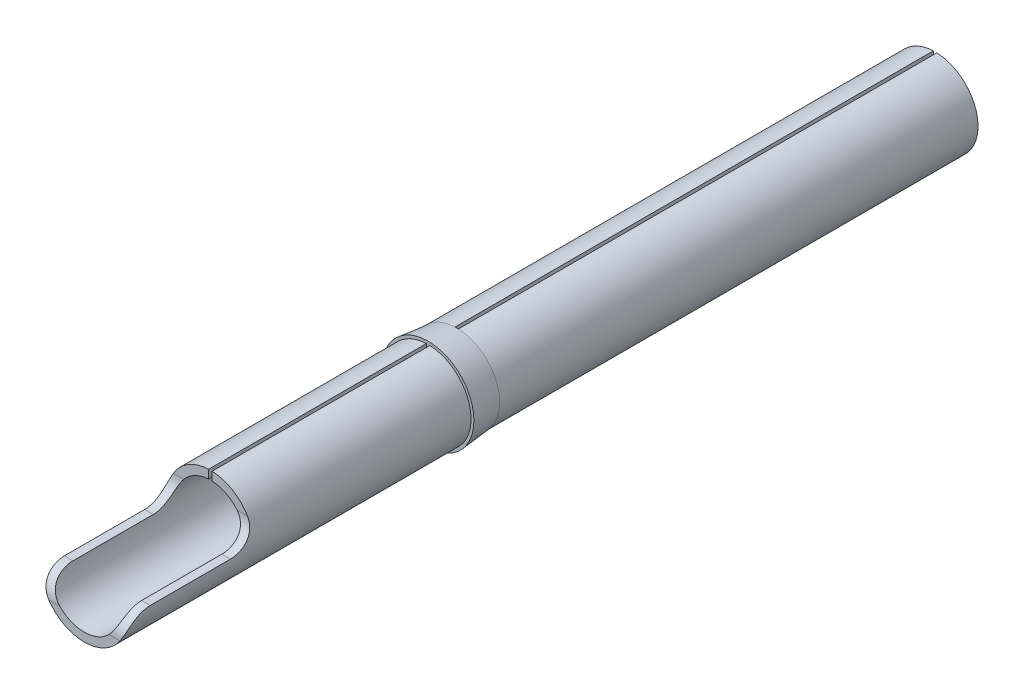
ISO-10303-21;
HEADER;
FILE_DESCRIPTION(('STEP AP214'),'2;1');
FILE_NAME('part.step','',(''),(''),'','','');
FILE_SCHEMA(('AUTOMOTIVE_DESIGN { 1 0 10303 214 1 1 1 1 }'));
ENDSEC;
DATA;
#1=APPLICATION_CONTEXT('core data for automotive mechanical design processes');
#2=APPLICATION_PROTOCOL_DEFINITION('international standard','automotive_design',2000,#1);
#3=PRODUCT_CONTEXT('',#1,'mechanical');
#4=PRODUCT('Part','Part','',(#3));
#5=PRODUCT_RELATED_PRODUCT_CATEGORY('part','',(#4));
#6=PRODUCT_DEFINITION_FORMATION('','',#4);
#7=PRODUCT_DEFINITION_CONTEXT('part definition',#1,'design');
#8=PRODUCT_DEFINITION('design','',#6,#7);
#9=PRODUCT_DEFINITION_SHAPE('','',#8);
#10=(LENGTH_UNIT() NAMED_UNIT(*) SI_UNIT(.MILLI.,.METRE.));
#11=(NAMED_UNIT(*) PLANE_ANGLE_UNIT() SI_UNIT($,.RADIAN.));
#12=(NAMED_UNIT(*) SI_UNIT($,.STERADIAN.) SOLID_ANGLE_UNIT());
#13=UNCERTAINTY_MEASURE_WITH_UNIT(LENGTH_MEASURE(1.E-05),#10,'distance_accuracy_value','');
#14=(GEOMETRIC_REPRESENTATION_CONTEXT(3) GLOBAL_UNCERTAINTY_ASSIGNED_CONTEXT((#13)) GLOBAL_UNIT_ASSIGNED_CONTEXT((#10,
#11,#12)) REPRESENTATION_CONTEXT('',''));
#15=CARTESIAN_POINT('',(0.,0.,0.));
#16=DIRECTION('',(0.,0.,1.));
#17=DIRECTION('',(1.,0.,0.));
#18=AXIS2_PLACEMENT_3D('',#15,#16,#17);
#19=CARTESIAN_POINT('',(0.,0.,5.1));
#20=DIRECTION('',(0.,0.,-1.));
#21=DIRECTION('',(-1.,0.,0.));
#22=AXIS2_PLACEMENT_3D('',#19,#20,#21);
#23=CYLINDRICAL_SURFACE('',#22,0.75);
#24=DIRECTION('',(0.,0.,1.));
#25=VECTOR('',#24,1.);
#26=CARTESIAN_POINT('',(-0.03,0.749399759807808,-0.162251976891754));
#27=LINE('',#26,#25);
#28=CARTESIAN_POINT('',(-0.03,0.749399759807808,8.85));
#29=VERTEX_POINT('',#28);
#30=CARTESIAN_POINT('',(-0.03,0.749399759807808,12.65));
#31=VERTEX_POINT('',#30);
#32=EDGE_CURVE('E219',#29,#31,#27,.T.);
#33=ORIENTED_EDGE('',*,*,#32,.F.);
#34=CARTESIAN_POINT('',(0.,0.,8.85));
#35=DIRECTION('',(0.,0.,1.));
#36=DIRECTION('',(1.,0.,0.));
#37=AXIS2_PLACEMENT_3D('',#34,#35,#36);
#38=CIRCLE('',#37,0.75);
#39=CARTESIAN_POINT('',(0.03,0.749399759807808,8.85));
#40=VERTEX_POINT('',#39);
#41=EDGE_CURVE('E12',#29,#40,#38,.T.);
#42=ORIENTED_EDGE('',*,*,#41,.T.);
#43=DIRECTION('',(0.,0.,1.));
#44=VECTOR('',#43,1.);
#45=CARTESIAN_POINT('',(0.03,0.749399759807808,-0.162251976891754));
#46=LINE('',#45,#44);
#47=CARTESIAN_POINT('',(0.03,0.749399759807808,12.65));
#48=VERTEX_POINT('',#47);
#49=EDGE_CURVE('E212',#40,#48,#46,.T.);
#50=ORIENTED_EDGE('',*,*,#49,.T.);
#51=CARTESIAN_POINT('',(0.,0.,12.65));
#52=DIRECTION('',(0.,0.,1.));
#53=DIRECTION('',(1.,0.,0.));
#54=AXIS2_PLACEMENT_3D('',#51,#52,#53);
#55=CIRCLE('',#54,0.75);
#56=CARTESIAN_POINT('',(0.646606526413089,0.38,12.65));
#57=VERTEX_POINT('',#56);
#58=EDGE_CURVE('E436',#57,#48,#55,.T.);
#59=ORIENTED_EDGE('',*,*,#58,.F.);
#60=CARTESIAN_POINT('',(0.646606526413089,0.38,12.65));
#61=CARTESIAN_POINT('',(0.657724577808599,0.361147262191826,12.6499726603906));
#62=CARTESIAN_POINT('',(0.667980805654465,0.341741106077158,12.6513334436148));
#63=CARTESIAN_POINT('',(0.686638428686348,0.302469029054215,12.6570904737169));
#64=CARTESIAN_POINT('',(0.695037548507881,0.282602576730625,12.6614904173239));
#65=CARTESIAN_POINT('',(0.709851274352495,0.243027928429155,12.673610274622));
#66=CARTESIAN_POINT('',(0.716257883219348,0.223320671726077,12.6813432772396));
#67=CARTESIAN_POINT('',(0.727098065936377,0.184997348853318,12.700102766926));
#68=CARTESIAN_POINT('',(0.73153456435778,0.166379701104829,12.7111243312792));
#69=CARTESIAN_POINT('',(0.738494724045411,0.131973775563877,12.7355121152411));
#70=CARTESIAN_POINT('',(0.74111226215507,0.116085089093548,12.7487107698996));
#71=CARTESIAN_POINT('',(0.745150890739631,0.0864534032905368,12.7774977454362));
#72=CARTESIAN_POINT('',(0.74657118992291,0.0727118279280763,12.7930876387253));
#73=CARTESIAN_POINT('',(0.748604708851185,0.0474928134771258,12.8266393660826));
#74=CARTESIAN_POINT('',(0.749197713387234,0.0360777197089919,12.8446491974092));
#75=CARTESIAN_POINT('',(0.749889341514227,0.0162482533497096,12.8822590287813));
#76=CARTESIAN_POINT('',(0.749987911673621,0.00783420516084064,12.901859200456));
#77=CARTESIAN_POINT('',(0.750010907579072,-0.0059133688295989,12.9425705774586));
#78=CARTESIAN_POINT('',(0.749931641275527,-0.0111786558540255,12.9637048381624));
#79=CARTESIAN_POINT('',(0.749780010416089,-0.0182313805133248,13.0065577390659));
#80=CARTESIAN_POINT('',(0.749707649872757,-0.0200168077526535,13.0282767097256));
#81=CARTESIAN_POINT('',(0.749733285909063,-0.0200000000000002,13.05));
#82=B_SPLINE_CURVE_WITH_KNOTS('',3,(#60,#61,#62,#63,#64,#65,#66,#67,#68,#69,#70,#71,#72,#73,#74,
#75,#76,#77,#78,#79,#80,#81),.UNSPECIFIED.,.F.,.F.,(4,2,2,2,2,2,2,2,2,2,4),(0.,
0.065654366199515,0.131388733048723,0.197383624960302,0.26328021919151,0.325455338419099,
0.387671518925662,0.45138282185834,0.515101009668951,0.580154258444718,0.64524507886098),.UNSPECIFIED.);
#83=CARTESIAN_POINT('',(0.749733285909063,-0.0200000000000002,13.05));
#84=VERTEX_POINT('',#83);
#85=EDGE_CURVE('E245',#57,#84,#82,.T.);
#86=ORIENTED_EDGE('',*,*,#85,.T.);
#87=DIRECTION('',(0.,0.,1.));
#88=VECTOR('',#87,1.);
#89=CARTESIAN_POINT('',(0.749733285909063,-0.0200000000000002,12.65));
#90=LINE('',#89,#88);
#91=CARTESIAN_POINT('',(0.749733285909063,-0.0200000000000002,14.45));
#92=VERTEX_POINT('',#91);
#93=EDGE_CURVE('E425',#84,#92,#90,.T.);
#94=ORIENTED_EDGE('',*,*,#93,.T.);
#95=CARTESIAN_POINT('',(0.749733285909063,-0.0200000000000002,14.45));
#96=CARTESIAN_POINT('',(0.749705313176335,-0.0199807945085876,14.4723986608576));
#97=CARTESIAN_POINT('',(0.749682612462895,-0.021880263276231,14.4947931044411));
#98=CARTESIAN_POINT('',(0.749441311613189,-0.0293784616436176,14.5389499411372));
#99=CARTESIAN_POINT('',(0.749222740780176,-0.0349766378633773,14.560712428291));
#100=CARTESIAN_POINT('',(0.748383080262654,-0.0497393583130032,14.6030034704527));
#101=CARTESIAN_POINT('',(0.747761711479095,-0.0589063736340716,14.6235311590818));
#102=CARTESIAN_POINT('',(0.74574397284353,-0.080523790813975,14.662735466125));
#103=CARTESIAN_POINT('',(0.744347769778462,-0.0929734857570693,14.6814124818864));
#104=CARTESIAN_POINT('',(0.740375622265052,-0.120559900099724,14.7161211057437));
#105=CARTESIAN_POINT('',(0.737815559255623,-0.135658818960957,14.732184494893));
#106=CARTESIAN_POINT('',(0.731110381922275,-0.16807886713201,14.7614675343962));
#107=CARTESIAN_POINT('',(0.726966754579019,-0.18539790162551,14.774689834416));
#108=CARTESIAN_POINT('',(0.717007953552366,-0.22072745205133,14.7974364173075));
#109=CARTESIAN_POINT('',(0.711276252396778,-0.238671931995108,14.807100166541));
#110=CARTESIAN_POINT('',(0.697938428802332,-0.275248279331061,14.8234283904866));
#111=CARTESIAN_POINT('',(0.690329667997059,-0.29388108260357,14.830088605889));
#112=CARTESIAN_POINT('',(0.673396038737874,-0.330820728403151,14.8403961606521));
#113=CARTESIAN_POINT('',(0.66409856443751,-0.349128275066788,14.8440871086032));
#114=CARTESIAN_POINT('',(0.643898424461736,-0.385135869133624,14.8488945527688));
#115=CARTESIAN_POINT('',(0.632999613084823,-0.402837252774911,14.850017126248));
#116=CARTESIAN_POINT('',(0.62136945531624,-0.42,14.85));
#117=B_SPLINE_CURVE_WITH_KNOTS('',3,(#95,#96,#97,#98,#99,#100,#101,#102,#103,#104,#105,#106,
#107,#108,#109,#110,#111,#112,#113,#114,#115,#116),.UNSPECIFIED.,.F.,.F.,(4,2,2,2,2,2,2,2,2,2,
4),(0.,0.0671099370928857,0.134209835844213,0.201356277942451,0.268488272037722,
0.33473050543094,0.400910689020773,0.464117228915708,0.527413122267665,0.589761512177078,
0.651962220631755),.UNSPECIFIED.);
#118=CARTESIAN_POINT('',(0.621369455316239,-0.42,14.85));
#119=VERTEX_POINT('',#118);
#120=EDGE_CURVE('E309',#92,#119,#117,.T.);
#121=ORIENTED_EDGE('',*,*,#120,.T.);
#122=CARTESIAN_POINT('',(0.,0.,14.85));
#123=DIRECTION('',(0.,0.,1.));
#124=DIRECTION('',(1.,0.,0.));
#125=AXIS2_PLACEMENT_3D('',#122,#123,#124);
#126=CIRCLE('',#125,0.75);
#127=CARTESIAN_POINT('',(-0.621369455316239,-0.42,14.85));
#128=VERTEX_POINT('',#127);
#129=EDGE_CURVE('E503',#128,#119,#126,.T.);
#130=ORIENTED_EDGE('',*,*,#129,.F.);
#131=CARTESIAN_POINT('',(-0.621369455316239,-0.42,14.85));
#132=CARTESIAN_POINT('',(-0.634038551035226,-0.401319786375606,14.850026150086));
#133=CARTESIAN_POINT('',(-0.645834332506215,-0.381988213252626,14.8486903658862));
#134=CARTESIAN_POINT('',(-0.667511937410535,-0.342664469991841,14.842950319651));
#135=CARTESIAN_POINT('',(-0.677389163049323,-0.322670844134552,14.8385387998863));
#136=CARTESIAN_POINT('',(-0.695042323699242,-0.282665306582724,14.8262702550832));
#137=CARTESIAN_POINT('',(-0.702808053538053,-0.262653759229463,14.8183969615894));
#138=CARTESIAN_POINT('',(-0.716172499288116,-0.223652927913043,14.7991690941988));
#139=CARTESIAN_POINT('',(-0.721775528058076,-0.204661675105278,14.7878215306277));
#140=CARTESIAN_POINT('',(-0.730702101327177,-0.169918819228703,14.7628607861136));
#141=CARTESIAN_POINT('',(-0.734167148402028,-0.154030545163575,14.7494870871664));
#142=CARTESIAN_POINT('',(-0.739764616090935,-0.12440284754241,14.7202873821128));
#143=CARTESIAN_POINT('',(-0.741896092900284,-0.110664951012497,14.7044596490815));
#144=CARTESIAN_POINT('',(-0.745196526854357,-0.0856907590195608,14.6706425117848));
#145=CARTESIAN_POINT('',(-0.74635702295795,-0.0744770638839885,14.6526356391279));
#146=CARTESIAN_POINT('',(-0.748042087113165,-0.0550270099208982,14.6150538207798));
#147=CARTESIAN_POINT('',(-0.748566604434882,-0.046790888641277,14.5954787501314));
#148=CARTESIAN_POINT('',(-0.74928314423158,-0.0334970373980666,14.5551954694437));
#149=CARTESIAN_POINT('',(-0.749473969002888,-0.0284507978880096,14.5344834517287));
#150=CARTESIAN_POINT('',(-0.749687628756679,-0.02169397447787,14.4925154516707));
#151=CARTESIAN_POINT('',(-0.749710412830097,-0.019984401558839,14.4712593064374));
#152=CARTESIAN_POINT('',(-0.749733285909063,-0.0200000000000002,14.45));
#153=B_SPLINE_CURVE_WITH_KNOTS('',3,(#131,#132,#133,#134,#135,#136,#137,#138,#139,#140,#141,
#142,#143,#144,#145,#146,#147,#148,#149,#150,#151,#152),.UNSPECIFIED.,.F.,.F.,(4,2,2,2,2,2,2,2,
2,2,4),(0.,0.0677233777854022,0.135607103830967,0.203813314280863,0.271882796371903,
0.334749156920054,0.397659959557488,0.461113414903698,0.524571931387288,0.588257751973154,
0.651962865816846),.UNSPECIFIED.);
#154=CARTESIAN_POINT('',(-0.749733285909063,-0.0200000000000002,14.45));
#155=VERTEX_POINT('',#154);
#156=EDGE_CURVE('E316',#128,#155,#153,.T.);
#157=ORIENTED_EDGE('',*,*,#156,.T.);
#158=DIRECTION('',(0.,0.,1.));
#159=VECTOR('',#158,1.);
#160=CARTESIAN_POINT('',(-0.749733285909063,-0.0200000000000002,12.65));
#161=LINE('',#160,#159);
#162=CARTESIAN_POINT('',(-0.749733285909063,-0.0200000000000002,13.05));
#163=VERTEX_POINT('',#162);
#164=EDGE_CURVE('E415',#163,#155,#161,.T.);
#165=ORIENTED_EDGE('',*,*,#164,.F.);
#166=CARTESIAN_POINT('',(-0.749733285909063,-0.0200000000000002,13.05));
#167=CARTESIAN_POINT('',(-0.749704126185465,-0.0200189142169892,13.0275313359366));
#168=CARTESIAN_POINT('',(-0.749783289186051,-0.0181079742170668,13.0050686242918));
#169=CARTESIAN_POINT('',(-0.749942638947083,-0.010564859823982,12.9607853201962));
#170=CARTESIAN_POINT('',(-0.750022825285848,-0.00493417255446931,12.9389644747728));
#171=CARTESIAN_POINT('',(-0.749968905825655,0.00991439656400444,12.8965640915088));
#172=CARTESIAN_POINT('',(-0.749834677875053,0.0191343209349248,12.8759852681795));
#173=CARTESIAN_POINT('',(-0.748963900449902,0.040889187303846,12.8366739115121));
#174=CARTESIAN_POINT('',(-0.748227411442792,0.0534237964196616,12.8179411930352));
#175=CARTESIAN_POINT('',(-0.74571170105682,0.0812831553212815,12.7830511391412));
#176=CARTESIAN_POINT('',(-0.743942652660174,0.0965796924044591,12.7668706077103));
#177=CARTESIAN_POINT('',(-0.738922591166215,0.129497000039341,12.7373728120609));
#178=CARTESIAN_POINT('',(-0.735672912775999,0.14711566717309,12.7240529849508));
#179=CARTESIAN_POINT('',(-0.727525283835041,0.183114362772149,12.7011886858946));
#180=CARTESIAN_POINT('',(-0.722711979628135,0.201419688840804,12.6914961970288));
#181=CARTESIAN_POINT('',(-0.711227994337885,0.238825874470472,12.6751845662024));
#182=CARTESIAN_POINT('',(-0.704555409873282,0.257927532119548,12.6685685923522));
#183=CARTESIAN_POINT('',(-0.690023493950282,0.294479258373856,12.6588331103184));
#184=CARTESIAN_POINT('',(-0.682322178297093,0.311925351067182,12.6554552697895));
#185=CARTESIAN_POINT('',(-0.66550084621469,0.346385416406222,12.6510339927043));
#186=CARTESIAN_POINT('',(-0.656383699741315,0.363400183944838,12.649985898051));
#187=CARTESIAN_POINT('',(-0.646606526413089,0.38,12.65));
#188=B_SPLINE_CURVE_WITH_KNOTS('',3,(#166,#167,#168,#169,#170,#171,#172,#173,#174,#175,#176,
#177,#178,#179,#180,#181,#182,#183,#184,#185,#186,#187),.UNSPECIFIED.,.F.,.F.,(4,2,2,2,2,2,2,2,
2,2,4),(0.,0.0673163137329924,0.13460573124395,0.201933497154372,0.269254504139053,
0.335923186355584,0.402531888936786,0.466010016155712,0.529553367431907,0.587453629540623,
0.645238021261109),.UNSPECIFIED.);
#189=CARTESIAN_POINT('',(-0.646606526413089,0.38,12.65));
#190=VERTEX_POINT('',#189);
#191=EDGE_CURVE('E288',#163,#190,#188,.T.);
#192=ORIENTED_EDGE('',*,*,#191,.T.);
#193=CARTESIAN_POINT('',(0.,0.,12.65));
#194=DIRECTION('',(0.,0.,1.));
#195=DIRECTION('',(1.,0.,0.));
#196=AXIS2_PLACEMENT_3D('',#193,#194,#195);
#197=CIRCLE('',#196,0.75);
#198=EDGE_CURVE('E397',#31,#190,#197,.T.);
#199=ORIENTED_EDGE('',*,*,#198,.F.);
#200=EDGE_LOOP('',(#33,#42,#50,#59,#86,#94,#121,#130,#157,#165,#192,#199));
#201=FACE_BOUND('',#200,.T.);
#202=ADVANCED_FACE('F36',(#201),#23,.T.);
#203=CARTESIAN_POINT('',(0.03,0.749399759807808,-0.162251976891754));
#204=DIRECTION('',(1.,0.,0.));
#205=DIRECTION('',(0.,1.,0.));
#206=AXIS2_PLACEMENT_3D('',#203,#204,#205);
#207=PLANE('',#206);
#208=ORIENTED_EDGE('',*,*,#49,.F.);
#209=DIRECTION('',(0.,-1.,0.));
#210=VECTOR('',#209,1.);
#211=CARTESIAN_POINT('',(0.03,0.749399759807808,8.85));
#212=LINE('',#211,#210);
#213=CARTESIAN_POINT('',(0.03,0.599249530663145,8.85));
#214=VERTEX_POINT('',#213);
#215=EDGE_CURVE('E54',#40,#214,#212,.T.);
#216=ORIENTED_EDGE('',*,*,#215,.T.);
#217=DIRECTION('',(0.,0.,1.));
#218=VECTOR('',#217,1.);
#219=CARTESIAN_POINT('',(0.0299999999999999,0.599249530663145,-0.162251976891754));
#220=LINE('',#219,#218);
#221=CARTESIAN_POINT('',(0.0299999999999999,0.599249530663145,9.2));
#222=VERTEX_POINT('',#221);
#223=EDGE_CURVE('E227',#214,#222,#220,.T.);
#224=ORIENTED_EDGE('',*,*,#223,.T.);
#225=CARTESIAN_POINT('',(0.0299999999999997,0.599249530663145,12.65));
#226=VERTEX_POINT('',#225);
#227=EDGE_CURVE('E228',#222,#226,#220,.T.);
#228=ORIENTED_EDGE('',*,*,#227,.T.);
#229=DIRECTION('',(0.,-1.,0.));
#230=VECTOR('',#229,1.);
#231=CARTESIAN_POINT('',(0.0299999999999999,0.599249530663145,12.65));
#232=LINE('',#231,#230);
#233=EDGE_CURVE('E434',#48,#226,#232,.T.);
#234=ORIENTED_EDGE('',*,*,#233,.F.);
#235=EDGE_LOOP('',(#208,#216,#224,#228,#234));
#236=FACE_BOUND('',#235,.T.);
#237=ADVANCED_FACE('F364',(#236),#207,.F.);
#238=CARTESIAN_POINT('',(-0.03,0.749399759807808,-0.162251976891754));
#239=DIRECTION('',(-1.,0.,0.));
#240=DIRECTION('',(0.,-1.,0.));
#241=AXIS2_PLACEMENT_3D('',#238,#239,#240);
#242=PLANE('',#241);
#243=DIRECTION('',(0.,0.,1.));
#244=VECTOR('',#243,1.);
#245=CARTESIAN_POINT('',(-0.03,0.599249530663146,-0.162251976891754));
#246=LINE('',#245,#244);
#247=CARTESIAN_POINT('',(-0.03,0.599249530663146,8.85));
#248=VERTEX_POINT('',#247);
#249=CARTESIAN_POINT('',(-0.03,0.599249530663146,9.2));
#250=VERTEX_POINT('',#249);
#251=EDGE_CURVE('E231',#248,#250,#246,.T.);
#252=ORIENTED_EDGE('',*,*,#251,.F.);
#253=DIRECTION('',(0.,1.,0.));
#254=VECTOR('',#253,1.);
#255=CARTESIAN_POINT('',(-0.03,0.749399759807808,8.85));
#256=LINE('',#255,#254);
#257=EDGE_CURVE('E205',#248,#29,#256,.T.);
#258=ORIENTED_EDGE('',*,*,#257,.T.);
#259=ORIENTED_EDGE('',*,*,#32,.T.);
#260=DIRECTION('',(0.,1.,0.));
#261=VECTOR('',#260,1.);
#262=CARTESIAN_POINT('',(-0.03,0.749399759807808,12.65));
#263=LINE('',#262,#261);
#264=CARTESIAN_POINT('',(-0.03,0.599249530663146,12.65));
#265=VERTEX_POINT('',#264);
#266=EDGE_CURVE('E421',#265,#31,#263,.T.);
#267=ORIENTED_EDGE('',*,*,#266,.F.);
#268=EDGE_CURVE('E232',#250,#265,#246,.T.);
#269=ORIENTED_EDGE('',*,*,#268,.F.);
#270=EDGE_LOOP('',(#252,#258,#259,#267,#269));
#271=FACE_BOUND('',#270,.T.);
#272=ADVANCED_FACE('F369',(#271),#242,.F.);
#273=CARTESIAN_POINT('',(0.,0.,-0.162251976891754));
#274=DIRECTION('',(0.,0.,1.));
#275=DIRECTION('',(1.,0.,0.));
#276=AXIS2_PLACEMENT_3D('',#273,#274,#275);
#277=CYLINDRICAL_SURFACE('',#276,0.6);
#278=ORIENTED_EDGE('',*,*,#223,.F.);
#279=CARTESIAN_POINT('',(0.,0.,8.85));
#280=DIRECTION('',(0.,0.,1.));
#281=DIRECTION('',(1.,0.,0.));
#282=AXIS2_PLACEMENT_3D('',#279,#280,#281);
#283=CIRCLE('',#282,0.6);
#284=EDGE_CURVE('E439',#214,#248,#283,.T.);
#285=ORIENTED_EDGE('',*,*,#284,.T.);
#286=ORIENTED_EDGE('',*,*,#251,.T.);
#287=CARTESIAN_POINT('',(0.,0.,9.2));
#288=DIRECTION('',(0.,0.,1.));
#289=DIRECTION('',(1.,0.,0.));
#290=AXIS2_PLACEMENT_3D('',#287,#288,#289);
#291=CIRCLE('',#290,0.6);
#292=EDGE_CURVE('E521',#222,#250,#291,.T.);
#293=ORIENTED_EDGE('',*,*,#292,.F.);
#294=EDGE_LOOP('',(#278,#285,#286,#293));
#295=FACE_BOUND('',#294,.T.);
#296=ADVANCED_FACE('F373',(#295),#277,.T.);
#297=CARTESIAN_POINT('',(0.,0.,14.85));
#298=DIRECTION('',(0.,0.,1.));
#299=DIRECTION('',(1.,0.,0.));
#300=AXIS2_PLACEMENT_3D('',#297,#298,#299);
#301=PLANE('',#300);
#302=CARTESIAN_POINT('',(0.,0.,14.85));
#303=DIRECTION('',(0.,0.,1.));
#304=DIRECTION('',(1.,0.,0.));
#305=AXIS2_PLACEMENT_3D('',#302,#303,#304);
#306=CIRCLE('',#305,0.6);
#307=CARTESIAN_POINT('',(-0.428485705712571,-0.42,14.85));
#308=VERTEX_POINT('',#307);
#309=CARTESIAN_POINT('',(0.428485705712571,-0.42,14.85));
#310=VERTEX_POINT('',#309);
#311=EDGE_CURVE('E516',#308,#310,#306,.T.);
#312=ORIENTED_EDGE('',*,*,#311,.F.);
#313=DIRECTION('',(1.,0.,0.));
#314=VECTOR('',#313,1.);
#315=CARTESIAN_POINT('',(-0.749733285909063,-0.42,14.85));
#316=LINE('',#315,#314);
#317=EDGE_CURVE('E317',#308,#128,#316,.F.);
#318=ORIENTED_EDGE('',*,*,#317,.T.);
#319=ORIENTED_EDGE('',*,*,#129,.T.);
#320=DIRECTION('',(1.,0.,0.));
#321=VECTOR('',#320,1.);
#322=CARTESIAN_POINT('',(0.599666574022598,-0.42,14.85));
#323=LINE('',#322,#321);
#324=EDGE_CURVE('E512',#119,#310,#323,.F.);
#325=ORIENTED_EDGE('',*,*,#324,.T.);
#326=EDGE_LOOP('',(#312,#318,#319,#325));
#327=FACE_BOUND('',#326,.T.);
#328=ADVANCED_FACE('F258',(#327),#301,.T.);
#329=CARTESIAN_POINT('',(0.,0.,9.2));
#330=DIRECTION('',(0.,0.,1.));
#331=DIRECTION('',(1.,0.,0.));
#332=AXIS2_PLACEMENT_3D('',#329,#330,#331);
#333=CYLINDRICAL_SURFACE('',#332,0.6);
#334=DIRECTION('',(0.,0.,1.));
#335=VECTOR('',#334,1.);
#336=CARTESIAN_POINT('',(-0.599666574022598,-0.0200000000000002,12.65));
#337=LINE('',#336,#335);
#338=CARTESIAN_POINT('',(-0.599666574022598,-0.0200000000000002,13.05));
#339=VERTEX_POINT('',#338);
#340=CARTESIAN_POINT('',(-0.599666574022598,-0.0200000000000002,14.45));
#341=VERTEX_POINT('',#340);
#342=EDGE_CURVE('E411',#339,#341,#337,.T.);
#343=ORIENTED_EDGE('',*,*,#342,.T.);
#344=CARTESIAN_POINT('',(-0.599666574022598,-0.0200000000000002,14.45));
#345=CARTESIAN_POINT('',(-0.599631879226092,-0.0199807509344362,14.4723363458454));
#346=CARTESIAN_POINT('',(-0.599603541815578,-0.0218698226645801,14.4946693036328));
#347=CARTESIAN_POINT('',(-0.599303732519249,-0.0293293869903454,14.5387222591123));
#348=CARTESIAN_POINT('',(-0.599032135950731,-0.0349017670852253,14.5604419365775));
#349=CARTESIAN_POINT('',(-0.597989039083257,-0.0495985342640726,14.6026553977839));
#350=CARTESIAN_POINT('',(-0.597217126028782,-0.0587258516482051,14.6231481540666));
#351=CARTESIAN_POINT('',(-0.594709372482395,-0.0802389705783777,14.6622732781189));
#352=CARTESIAN_POINT('',(-0.592974084936333,-0.0926229007897571,14.6809067058518));
#353=CARTESIAN_POINT('',(-0.588052970704351,-0.119921714727915,14.7153794580403));
#354=CARTESIAN_POINT('',(-0.584897824432352,-0.134779079830041,14.7312685174781));
#355=CARTESIAN_POINT('',(-0.576649054617546,-0.166565992741692,14.7602134098341));
#356=CARTESIAN_POINT('',(-0.571556700078189,-0.18349417910764,14.773271088727));
#357=CARTESIAN_POINT('',(-0.559492001813011,-0.217417808381381,14.7954617530577));
#358=CARTESIAN_POINT('',(-0.552668202565208,-0.234333004430053,14.8047988439427));
#359=CARTESIAN_POINT('',(-0.536905707292843,-0.268487734632465,14.8206735171407));
#360=CARTESIAN_POINT('',(-0.527966621807923,-0.285727327974618,14.8272105832977));
#361=CARTESIAN_POINT('',(-0.508166208777229,-0.319606295558499,14.8375977065273));
#362=CARTESIAN_POINT('',(-0.497328328345093,-0.336250307517359,14.8414779892914));
#363=CARTESIAN_POINT('',(-0.473857803233264,-0.368588325312091,14.8470214753734));
#364=CARTESIAN_POINT('',(-0.461226089556268,-0.384282817962248,14.8486858241449));
#365=CARTESIAN_POINT('',(-0.44154186636508,-0.406363426285536,14.8498300610353));
#366=CARTESIAN_POINT('',(-0.435091995573201,-0.413263724604454,14.8500008044895));
#367=CARTESIAN_POINT('',(-0.428485705712571,-0.42,14.85));
#368=B_SPLINE_CURVE_WITH_KNOTS('',3,(#344,#345,#346,#347,#348,#349,#350,#351,#352,#353,#354,
#355,#356,#357,#358,#359,#360,#361,#362,#363,#364,#365,#366,#367),.UNSPECIFIED.,.F.,.F.,(4,2,2,
2,2,2,2,2,2,2,2,4),(0.,0.0669250645474766,0.13388445124002,0.200899149113131,0.267875422421189,
0.333469215822817,0.399020114604313,0.460186123826203,0.521363403530469,0.581832570659751,
0.642270468106635,0.670588514786966),.UNSPECIFIED.);
#369=EDGE_CURVE('E274',#341,#308,#368,.T.);
#370=ORIENTED_EDGE('',*,*,#369,.T.);
#371=ORIENTED_EDGE('',*,*,#311,.T.);
#372=CARTESIAN_POINT('',(0.428485705712571,-0.42,14.85));
#373=CARTESIAN_POINT('',(0.444362370462389,-0.403857930331165,14.8500184051036));
#374=CARTESIAN_POINT('',(0.459313988302575,-0.386720092480086,14.8490213967222));
#375=CARTESIAN_POINT('',(0.487114972572964,-0.351027915537235,14.8444170114652));
#376=CARTESIAN_POINT('',(0.499954777741047,-0.332467663226635,14.8407981427751));
#377=CARTESIAN_POINT('',(0.523207398102215,-0.294540477593908,14.8303273184273));
#378=CARTESIAN_POINT('',(0.53360441001466,-0.275169198034222,14.8234551334826));
#379=CARTESIAN_POINT('',(0.551698721859665,-0.236804550989114,14.8062014904354));
#380=CARTESIAN_POINT('',(0.559404384829265,-0.217810188976539,14.7958311036356));
#381=CARTESIAN_POINT('',(0.571604316039166,-0.183217757025882,14.7729805847126));
#382=CARTESIAN_POINT('',(0.576357334647368,-0.167475289975147,14.760854366337));
#383=CARTESIAN_POINT('',(0.584177487903572,-0.137744183821039,14.7341328512668));
#384=CARTESIAN_POINT('',(0.587242974203764,-0.123757269762589,14.7195351586148));
#385=CARTESIAN_POINT('',(0.592066945248931,-0.0981168201817156,14.6883234454439));
#386=CARTESIAN_POINT('',(0.593829946225618,-0.0864553252096507,14.6717166267515));
#387=CARTESIAN_POINT('',(0.596477486087554,-0.0657557678789761,14.6368741461632));
#388=CARTESIAN_POINT('',(0.597361663262593,-0.0567187868117114,14.6186378169491));
#389=CARTESIAN_POINT('',(0.598653482316777,-0.0409954424563313,14.5797139161439));
#390=CARTESIAN_POINT('',(0.599024740655378,-0.0345100527268165,14.5589439801755));
#391=CARTESIAN_POINT('',(0.599498781641201,-0.0249993296254437,14.516653285598));
#392=CARTESIAN_POINT('',(0.599602031832554,-0.0219679758291977,14.4951339009881));
#393=CARTESIAN_POINT('',(0.599657957471802,-0.020230087524691,14.4656936407773));
#394=CARTESIAN_POINT('',(0.599664656722086,-0.019998589432636,14.4578448982108));
#395=CARTESIAN_POINT('',(0.599666574022598,-0.0200000000000001,14.45));
#396=B_SPLINE_CURVE_WITH_KNOTS('',3,(#372,#373,#374,#375,#376,#377,#378,#379,#380,#381,#382,
#383,#384,#385,#386,#387,#388,#389,#390,#391,#392,#393,#394,#395),.UNSPECIFIED.,.F.,.F.,(4,2,2,
2,2,2,2,2,2,2,2,4),(0.,0.0679596441256934,0.136218976679906,0.204908438793306,0.273382517096574,
0.334381316923291,0.395439593912302,0.456285151085444,0.517155740986458,0.582154380142338,
0.647039551778461,0.670581207077292),.UNSPECIFIED.);
#397=CARTESIAN_POINT('',(0.599666574022598,-0.0200000000000002,14.45));
#398=VERTEX_POINT('',#397);
#399=EDGE_CURVE('E265',#310,#398,#396,.T.);
#400=ORIENTED_EDGE('',*,*,#399,.T.);
#401=DIRECTION('',(0.,0.,1.));
#402=VECTOR('',#401,1.);
#403=CARTESIAN_POINT('',(0.599666574022598,-0.0200000000000002,12.65));
#404=LINE('',#403,#402);
#405=CARTESIAN_POINT('',(0.599666574022598,-0.0200000000000002,13.05));
#406=VERTEX_POINT('',#405);
#407=EDGE_CURVE('E426',#406,#398,#404,.T.);
#408=ORIENTED_EDGE('',*,*,#407,.F.);
#409=CARTESIAN_POINT('',(0.599666574022598,-0.0200000000000002,13.05));
#410=CARTESIAN_POINT('',(0.599630275501126,-0.0200188025680276,13.0275539675079));
#411=CARTESIAN_POINT('',(0.599728969436699,-0.018111780841702,13.0051140061057));
#412=CARTESIAN_POINT('',(0.599927926644706,-0.0105820147400152,12.9608632495048));
#413=CARTESIAN_POINT('',(0.600028190070245,-0.00495890562361673,12.9390525162852));
#414=CARTESIAN_POINT('',(0.599961751632812,0.00987169486560765,12.8966686429413));
#415=CARTESIAN_POINT('',(0.59979488279709,0.019081425356065,12.8760962852127));
#416=CARTESIAN_POINT('',(0.598709669535728,0.040808828962328,12.8368037994377));
#417=CARTESIAN_POINT('',(0.597791589356954,0.0533253378342551,12.8180830226724));
#418=CARTESIAN_POINT('',(0.594661421596879,0.0810468580559096,12.7833290002072));
#419=CARTESIAN_POINT('',(0.592469184733962,0.0962081827108696,12.7672592778626));
#420=CARTESIAN_POINT('',(0.586255621551167,0.128753670956124,12.7379851560393));
#421=CARTESIAN_POINT('',(0.582235696080012,0.146136124819012,12.7247785735087));
#422=CARTESIAN_POINT('',(0.572297682399287,0.181055644820921,12.7024070109782));
#423=CARTESIAN_POINT('',(0.566532303141352,0.198496566876472,12.693023706438));
#424=CARTESIAN_POINT('',(0.552873574798764,0.23385801114281,12.677148589263));
#425=CARTESIAN_POINT('',(0.544979774209192,0.251778634385909,12.6706573909104));
#426=CARTESIAN_POINT('',(0.527374890568694,0.286789663668143,12.6605979930823));
#427=CARTESIAN_POINT('',(0.517727825217379,0.303888573003312,12.6569453138085));
#428=CARTESIAN_POINT('',(0.496633409572038,0.337259839201099,12.6519325079015));
#429=CARTESIAN_POINT('',(0.485188103243313,0.353533107077633,12.6505697987015));
#430=CARTESIAN_POINT('',(0.470126346464817,0.372830865955476,12.6500475690756));
#431=CARTESIAN_POINT('',(0.467247115013931,0.37643318125478,12.6499997688418));
#432=CARTESIAN_POINT('',(0.464327470649756,0.38,12.65));
#433=B_SPLINE_CURVE_WITH_KNOTS('',3,(#409,#410,#411,#412,#413,#414,#415,#416,#417,#418,#419,
#420,#421,#422,#423,#424,#425,#426,#427,#428,#429,#430,#431,#432),.UNSPECIFIED.,.F.,.F.,(4,2,2,
2,2,2,2,2,2,2,2,4),(0.,0.0672484954631609,0.134503592474433,0.201800744136269,0.269074233455201,
0.335326708129403,0.401528488367822,0.463092380229844,0.524669342012787,0.584334855614532,
0.643933034782042,0.657765534034936),.UNSPECIFIED.);
#434=CARTESIAN_POINT('',(0.464327470649756,0.38,12.65));
#435=VERTEX_POINT('',#434);
#436=EDGE_CURVE('E181',#406,#435,#433,.T.);
#437=ORIENTED_EDGE('',*,*,#436,.T.);
#438=CARTESIAN_POINT('',(0.,0.,12.65));
#439=DIRECTION('',(0.,0.,-1.));
#440=DIRECTION('',(1.,0.,0.));
#441=AXIS2_PLACEMENT_3D('',#438,#439,#440);
#442=CIRCLE('',#441,0.6);
#443=EDGE_CURVE('E429',#226,#435,#442,.T.);
#444=ORIENTED_EDGE('',*,*,#443,.F.);
#445=ORIENTED_EDGE('',*,*,#227,.F.);
#446=EDGE_CURVE('E517',#250,#222,#291,.T.);
#447=ORIENTED_EDGE('',*,*,#446,.F.);
#448=ORIENTED_EDGE('',*,*,#268,.T.);
#449=CARTESIAN_POINT('',(0.,0.,12.65));
#450=DIRECTION('',(0.,0.,-1.));
#451=DIRECTION('',(1.,0.,0.));
#452=AXIS2_PLACEMENT_3D('',#449,#450,#451);
#453=CIRCLE('',#452,0.6);
#454=CARTESIAN_POINT('',(-0.464327470649756,0.38,12.65));
#455=VERTEX_POINT('',#454);
#456=EDGE_CURVE('E423',#455,#265,#453,.T.);
#457=ORIENTED_EDGE('',*,*,#456,.F.);
#458=CARTESIAN_POINT('',(-0.464327470649756,0.38,12.65));
#459=CARTESIAN_POINT('',(-0.47802094970486,0.363324906981983,12.6499771166857));
#460=CARTESIAN_POINT('',(-0.490791847102532,0.345827241709667,12.6510436473586));
#461=CARTESIAN_POINT('',(-0.514283861650793,0.309781453759559,12.6557965738162));
#462=CARTESIAN_POINT('',(-0.524999445143812,0.291230664794749,12.659489919638));
#463=CARTESIAN_POINT('',(-0.544151278429918,0.253670030105614,12.6699698154096));
#464=CARTESIAN_POINT('',(-0.552575221900316,0.23465828073251,12.6767725596692));
#465=CARTESIAN_POINT('',(-0.56701592124226,0.197216325995862,12.6936153987933));
#466=CARTESIAN_POINT('',(-0.573038176335859,0.178784882140282,12.7036480017546));
#467=CARTESIAN_POINT('',(-0.58251221479594,0.144797108545944,12.7258729427305));
#468=CARTESIAN_POINT('',(-0.586132962218628,0.129128842405005,12.7378238819074));
#469=CARTESIAN_POINT('',(-0.591871935083404,0.0995728474223462,12.764077375319));
#470=CARTESIAN_POINT('',(-0.593988805416914,0.0856867336428126,12.778382036182));
#471=CARTESIAN_POINT('',(-0.597149231900144,0.0598820571403064,12.8092953306613));
#472=CARTESIAN_POINT('',(-0.598168838503526,0.0480119839054879,12.8259467345818));
#473=CARTESIAN_POINT('',(-0.599488325238437,0.0269367884634138,12.8608888722519));
#474=CARTESIAN_POINT('',(-0.599787860862733,0.0177329437247352,12.8791803863486));
#475=CARTESIAN_POINT('',(-0.600055622549445,0.00165695048521532,12.918331757663));
#476=CARTESIAN_POINT('',(-0.59999812856331,-0.00499654213260674,12.9392816447925));
#477=CARTESIAN_POINT('',(-0.599838965213154,-0.0147758842536402,12.9819588312953));
#478=CARTESIAN_POINT('',(-0.599737374589197,-0.0179079860164619,13.003684681923));
#479=CARTESIAN_POINT('',(-0.599673861895133,-0.0197505610131633,13.0336596752581));
#480=CARTESIAN_POINT('',(-0.599664318665029,-0.0200015610629523,13.0418318675969));
#481=CARTESIAN_POINT('',(-0.599666574022598,-0.0200000000000002,13.05));
#482=B_SPLINE_CURVE_WITH_KNOTS('',3,(#458,#459,#460,#461,#462,#463,#464,#465,#466,#467,#468,
#469,#470,#471,#472,#473,#474,#475,#476,#477,#478,#479,#480,#481),.UNSPECIFIED.,.F.,.F.,(4,2,2,
2,2,2,2,2,2,2,2,4),(0.,0.0647488275973712,0.129669608237877,0.194932429972117,0.260044947349606,
0.3198724080579,0.379753709753774,0.440917046530583,0.502109640176098,0.567759212525456,
0.633292038506541,0.657803559399651),.UNSPECIFIED.);
#483=EDGE_CURVE('E282',#455,#339,#482,.T.);
#484=ORIENTED_EDGE('',*,*,#483,.T.);
#485=EDGE_LOOP('',(#343,#370,#371,#400,#408,#437,#444,#445,#447,#448,#457,#484));
#486=FACE_BOUND('',#485,.T.);
#487=ADVANCED_FACE('F252',(#486),#333,.F.);
#488=CARTESIAN_POINT('',(0.,0.,9.2));
#489=DIRECTION('',(0.,0.,1.));
#490=DIRECTION('',(1.,0.,0.));
#491=AXIS2_PLACEMENT_3D('',#488,#489,#490);
#492=PLANE('',#491);
#493=ORIENTED_EDGE('',*,*,#292,.T.);
#494=ORIENTED_EDGE('',*,*,#446,.T.);
#495=EDGE_LOOP('',(#493,#494));
#496=FACE_BOUND('',#495,.T.);
#497=ADVANCED_FACE('F257',(#496),#492,.T.);
#498=CARTESIAN_POINT('',(-0.749733285909063,-0.0200000000000002,12.65));
#499=DIRECTION('',(0.,-1.,0.));
#500=DIRECTION('',(0.,0.,-1.));
#501=AXIS2_PLACEMENT_3D('',#498,#499,#500);
#502=PLANE('',#501);
#503=ORIENTED_EDGE('',*,*,#164,.T.);
#504=DIRECTION('',(1.,0.,0.));
#505=VECTOR('',#504,1.);
#506=CARTESIAN_POINT('',(-0.599666574022598,-0.0200000000000002,14.45));
#507=LINE('',#506,#505);
#508=EDGE_CURVE('E509',#155,#341,#507,.T.);
#509=ORIENTED_EDGE('',*,*,#508,.T.);
#510=ORIENTED_EDGE('',*,*,#342,.F.);
#511=DIRECTION('',(1.,0.,0.));
#512=VECTOR('',#511,1.);
#513=CARTESIAN_POINT('',(-0.749733285909063,-0.0200000000000002,13.05));
#514=LINE('',#513,#512);
#515=EDGE_CURVE('E362',#339,#163,#514,.F.);
#516=ORIENTED_EDGE('',*,*,#515,.T.);
#517=EDGE_LOOP('',(#503,#509,#510,#516));
#518=FACE_BOUND('',#517,.T.);
#519=ADVANCED_FACE('F371',(#518),#502,.F.);
#520=CARTESIAN_POINT('',(0.,0.,12.65));
#521=DIRECTION('',(0.,0.,1.));
#522=DIRECTION('',(1.,0.,0.));
#523=AXIS2_PLACEMENT_3D('',#520,#521,#522);
#524=PLANE('',#523);
#525=ORIENTED_EDGE('',*,*,#198,.T.);
#526=DIRECTION('',(1.,0.,0.));
#527=VECTOR('',#526,1.);
#528=CARTESIAN_POINT('',(0.,0.38,12.65));
#529=LINE('',#528,#527);
#530=EDGE_CURVE('E487',#190,#455,#529,.T.);
#531=ORIENTED_EDGE('',*,*,#530,.T.);
#532=ORIENTED_EDGE('',*,*,#456,.T.);
#533=ORIENTED_EDGE('',*,*,#266,.T.);
#534=EDGE_LOOP('',(#525,#531,#532,#533));
#535=FACE_BOUND('',#534,.T.);
#536=ADVANCED_FACE('F477',(#535),#524,.T.);
#537=CARTESIAN_POINT('',(0.599666574022598,-0.0200000000000002,12.65));
#538=DIRECTION('',(0.,-1.,0.));
#539=DIRECTION('',(0.,0.,-1.));
#540=AXIS2_PLACEMENT_3D('',#537,#538,#539);
#541=PLANE('',#540);
#542=ORIENTED_EDGE('',*,*,#407,.T.);
#543=DIRECTION('',(1.,0.,0.));
#544=VECTOR('',#543,1.);
#545=CARTESIAN_POINT('',(0.749733285909063,-0.0200000000000002,14.45));
#546=LINE('',#545,#544);
#547=EDGE_CURVE('E491',#398,#92,#546,.T.);
#548=ORIENTED_EDGE('',*,*,#547,.T.);
#549=ORIENTED_EDGE('',*,*,#93,.F.);
#550=DIRECTION('',(1.,0.,0.));
#551=VECTOR('',#550,1.);
#552=CARTESIAN_POINT('',(0.599666574022598,-0.0200000000000002,13.05));
#553=LINE('',#552,#551);
#554=EDGE_CURVE('E494',#84,#406,#553,.F.);
#555=ORIENTED_EDGE('',*,*,#554,.T.);
#556=EDGE_LOOP('',(#542,#548,#549,#555));
#557=FACE_BOUND('',#556,.T.);
#558=ADVANCED_FACE('F474',(#557),#541,.F.);
#559=CARTESIAN_POINT('',(0.,0.,12.65));
#560=DIRECTION('',(0.,0.,1.));
#561=DIRECTION('',(1.,0.,0.));
#562=AXIS2_PLACEMENT_3D('',#559,#560,#561);
#563=PLANE('',#562);
#564=ORIENTED_EDGE('',*,*,#443,.T.);
#565=DIRECTION('',(1.,0.,0.));
#566=VECTOR('',#565,1.);
#567=CARTESIAN_POINT('',(0.,0.38,12.65));
#568=LINE('',#567,#566);
#569=EDGE_CURVE('E289',#435,#57,#568,.T.);
#570=ORIENTED_EDGE('',*,*,#569,.T.);
#571=ORIENTED_EDGE('',*,*,#58,.T.);
#572=ORIENTED_EDGE('',*,*,#233,.T.);
#573=EDGE_LOOP('',(#564,#570,#571,#572));
#574=FACE_BOUND('',#573,.T.);
#575=ADVANCED_FACE('F471',(#574),#563,.T.);
#576=CARTESIAN_POINT('',(-0.749733285909063,-0.42,14.45));
#577=DIRECTION('',(-1.,0.,0.));
#578=DIRECTION('',(0.,0.,1.));
#579=AXIS2_PLACEMENT_3D('',#576,#577,#578);
#580=CYLINDRICAL_SURFACE('',#579,0.4);
#581=ORIENTED_EDGE('',*,*,#156,.F.);
#582=ORIENTED_EDGE('',*,*,#317,.F.);
#583=ORIENTED_EDGE('',*,*,#369,.F.);
#584=ORIENTED_EDGE('',*,*,#508,.F.);
#585=EDGE_LOOP('',(#581,#582,#583,#584));
#586=FACE_BOUND('',#585,.T.);
#587=ADVANCED_FACE('F303',(#586),#580,.T.);
#588=CARTESIAN_POINT('',(0.599666574022598,-0.42,14.45));
#589=DIRECTION('',(-1.,0.,0.));
#590=DIRECTION('',(0.,0.,1.));
#591=AXIS2_PLACEMENT_3D('',#588,#589,#590);
#592=CYLINDRICAL_SURFACE('',#591,0.4);
#593=ORIENTED_EDGE('',*,*,#399,.F.);
#594=ORIENTED_EDGE('',*,*,#324,.F.);
#595=ORIENTED_EDGE('',*,*,#120,.F.);
#596=ORIENTED_EDGE('',*,*,#547,.F.);
#597=EDGE_LOOP('',(#593,#594,#595,#596));
#598=FACE_BOUND('',#597,.T.);
#599=ADVANCED_FACE('F298',(#598),#592,.T.);
#600=CARTESIAN_POINT('',(0.,0.38,13.05));
#601=DIRECTION('',(1.,0.,0.));
#602=DIRECTION('',(0.,0.,-1.));
#603=AXIS2_PLACEMENT_3D('',#600,#601,#602);
#604=CYLINDRICAL_SURFACE('',#603,0.4);
#605=ORIENTED_EDGE('',*,*,#191,.F.);
#606=ORIENTED_EDGE('',*,*,#515,.F.);
#607=ORIENTED_EDGE('',*,*,#483,.F.);
#608=ORIENTED_EDGE('',*,*,#530,.F.);
#609=EDGE_LOOP('',(#605,#606,#607,#608));
#610=FACE_BOUND('',#609,.T.);
#611=ADVANCED_FACE('F295',(#610),#604,.F.);
#612=CARTESIAN_POINT('',(0.,0.38,13.05));
#613=DIRECTION('',(1.,0.,0.));
#614=DIRECTION('',(0.,0.,-1.));
#615=AXIS2_PLACEMENT_3D('',#612,#613,#614);
#616=CYLINDRICAL_SURFACE('',#615,0.4);
#617=ORIENTED_EDGE('',*,*,#436,.F.);
#618=ORIENTED_EDGE('',*,*,#554,.F.);
#619=ORIENTED_EDGE('',*,*,#85,.F.);
#620=ORIENTED_EDGE('',*,*,#569,.F.);
#621=EDGE_LOOP('',(#617,#618,#619,#620));
#622=FACE_BOUND('',#621,.T.);
#623=ADVANCED_FACE('F38',(#622),#616,.F.);
#624=CARTESIAN_POINT('',(0.,0.,8.35));
#625=DIRECTION('',(0.,0.,1.));
#626=DIRECTION('',(1.,0.,0.));
#627=AXIS2_PLACEMENT_3D('',#624,#625,#626);
#628=PLANE('',#627);
#629=CARTESIAN_POINT('',(0.,0.,8.35));
#630=DIRECTION('',(0.,0.,1.));
#631=DIRECTION('',(1.,0.,0.));
#632=AXIS2_PLACEMENT_3D('',#629,#630,#631);
#633=CIRCLE('',#632,0.75);
#634=CARTESIAN_POINT('',(0.0300000546319461,0.749401102741028,8.35));
#635=VERTEX_POINT('',#634);
#636=CARTESIAN_POINT('',(-0.03,0.749399759807808,8.35));
#637=VERTEX_POINT('',#636);
#638=EDGE_CURVE('E41',#635,#637,#633,.T.);
#639=ORIENTED_EDGE('',*,*,#638,.F.);
#640=DIRECTION('',(0.,-1.,0.));
#641=VECTOR('',#640,1.);
#642=CARTESIAN_POINT('',(0.03,0.749399759807808,8.35));
#643=LINE('',#642,#641);
#644=CARTESIAN_POINT('',(0.0299999999999999,0.599249530663145,8.35));
#645=VERTEX_POINT('',#644);
#646=EDGE_CURVE('E189',#635,#645,#643,.T.);
#647=ORIENTED_EDGE('',*,*,#646,.T.);
#648=CARTESIAN_POINT('',(0.,0.,8.35));
#649=DIRECTION('',(0.,0.,1.));
#650=DIRECTION('',(1.,0.,0.));
#651=AXIS2_PLACEMENT_3D('',#648,#649,#650);
#652=CIRCLE('',#651,0.6);
#653=CARTESIAN_POINT('',(-0.03,0.599249530663145,8.35));
#654=VERTEX_POINT('',#653);
#655=EDGE_CURVE('E448',#645,#654,#652,.T.);
#656=ORIENTED_EDGE('',*,*,#655,.T.);
#657=DIRECTION('',(0.,1.,0.));
#658=VECTOR('',#657,1.);
#659=CARTESIAN_POINT('',(-0.03,0.749399759807808,8.35));
#660=LINE('',#659,#658);
#661=EDGE_CURVE('E192',#654,#637,#660,.T.);
#662=ORIENTED_EDGE('',*,*,#661,.T.);
#663=EDGE_LOOP('',(#639,#647,#656,#662));
#664=FACE_BOUND('',#663,.T.);
#665=ADVANCED_FACE('F188',(#664),#628,.F.);
#666=CARTESIAN_POINT('',(0.,0.,8.85));
#667=DIRECTION('',(0.,0.,1.));
#668=DIRECTION('',(1.,0.,0.));
#669=AXIS2_PLACEMENT_3D('',#666,#667,#668);
#670=PLANE('',#669);
#671=ORIENTED_EDGE('',*,*,#284,.F.);
#672=ORIENTED_EDGE('',*,*,#215,.F.);
#673=ORIENTED_EDGE('',*,*,#41,.F.);
#674=ORIENTED_EDGE('',*,*,#257,.F.);
#675=EDGE_LOOP('',(#671,#672,#673,#674));
#676=FACE_BOUND('',#675,.T.);
#677=CARTESIAN_POINT('',(0.,0.,8.85));
#678=DIRECTION('',(0.,0.,1.));
#679=DIRECTION('',(1.,0.,0.));
#680=AXIS2_PLACEMENT_3D('',#677,#678,#679);
#681=CIRCLE('',#680,0.8);
#682=CARTESIAN_POINT('',(0.8,0.,8.85));
#683=VERTEX_POINT('',#682);
#684=EDGE_CURVE('E193',#683,#683,#681,.T.);
#685=ORIENTED_EDGE('',*,*,#684,.T.);
#686=EDGE_LOOP('',(#685));
#687=FACE_BOUND('',#686,.T.);
#688=ADVANCED_FACE('F459',(#676,#687),#670,.T.);
#689=CARTESIAN_POINT('',(0.,0.,8.35));
#690=DIRECTION('',(0.,0.,1.));
#691=DIRECTION('',(1.,0.,0.));
#692=AXIS2_PLACEMENT_3D('',#689,#690,#691);
#693=CONICAL_SURFACE('',#692,0.75,0.0996686524911618);
#694=ORIENTED_EDGE('',*,*,#638,.T.);
#695=CARTESIAN_POINT('',(0.,0.,8.35));
#696=DIRECTION('',(0.,0.,-1.));
#697=DIRECTION('',(0.04,0.999199679743744,0.));
#698=AXIS2_PLACEMENT_3D('',#695,#696,#697);
#699=CIRCLE('',#698,0.75);
#700=EDGE_CURVE('E47',#635,#637,#699,.T.);
#701=ORIENTED_EDGE('',*,*,#700,.F.);
#702=EDGE_LOOP('',(#694,#701));
#703=FACE_BOUND('',#702,.T.);
#704=ORIENTED_EDGE('',*,*,#684,.F.);
#705=EDGE_LOOP('',(#704));
#706=FACE_BOUND('',#705,.T.);
#707=ADVANCED_FACE('F174',(#703,#706),#693,.T.);
#708=CARTESIAN_POINT('',(0.,0.,0.15));
#709=DIRECTION('',(0.,0.,1.));
#710=DIRECTION('',(1.,0.,0.));
#711=AXIS2_PLACEMENT_3D('',#708,#709,#710);
#712=TOROIDAL_SURFACE('',#711,0.65,0.15);
#713=CARTESIAN_POINT('',(0.03,0.649307323229917,0.));
#714=CARTESIAN_POINT('',(0.03,0.640849834167162,-7.13059345823021E-06));
#715=CARTESIAN_POINT('',(0.03,0.632394503153146,0.00071334180956821));
#716=CARTESIAN_POINT('',(0.03,0.615729317722049,0.00355649881208608));
#717=CARTESIAN_POINT('',(0.03,0.607519280228503,0.00567810887856287));
#718=CARTESIAN_POINT('',(0.03,0.591568348392068,0.0112720352399438));
#719=CARTESIAN_POINT('',(0.03,0.583827680577142,0.0147449978233746));
#720=CARTESIAN_POINT('',(0.03,0.569040657883012,0.0229403643865132));
#721=CARTESIAN_POINT('',(0.03,0.561994179665596,0.0276625458632711));
#722=CARTESIAN_POINT('',(0.03,0.548796161807189,0.0382224125252508));
#723=CARTESIAN_POINT('',(0.03,0.542644417314929,0.0440598416617104));
#724=CARTESIAN_POINT('',(0.03,0.531408385393881,0.0566870591679692));
#725=CARTESIAN_POINT('',(0.03,0.526324303417256,0.0634770304185616));
#726=CARTESIAN_POINT('',(0.03,0.517375377716227,0.0778078272575956));
#727=CARTESIAN_POINT('',(0.03,0.513509357483361,0.0853479189935225));
#728=CARTESIAN_POINT('',(0.03,0.507102456638289,0.100969314305887));
#729=CARTESIAN_POINT('',(0.03,0.504560767293383,0.109050284172058));
#730=CARTESIAN_POINT('',(0.03,0.501514892187227,0.122651657697681));
#731=CARTESIAN_POINT('',(0.03,0.500609560038508,0.128085592676533));
#732=CARTESIAN_POINT('',(0.03,0.499401789446754,0.139012247683379));
#733=CARTESIAN_POINT('',(0.03,0.499098499334591,0.14450487360273));
#734=CARTESIAN_POINT('',(0.03,0.499099188538092,0.149999999999862));
#735=B_SPLINE_CURVE_WITH_KNOTS('',3,(#713,#714,#715,#716,#717,#718,#719,#720,#721,#722,#723,
#724,#725,#726,#727,#728,#729,#730,#731,#732,#733,#734),.UNSPECIFIED.,.F.,.F.,(4,2,2,2,2,2,2,2,
2,2,4),(0.,0.0253387507119228,0.0506580916567625,0.0759895565676748,0.101316512632899,
0.126637660876388,0.151963677256733,0.177265156070477,0.20255116579975,0.219046665555148,
0.235518813538798),.UNSPECIFIED.);
#736=CARTESIAN_POINT('',(0.03,0.649307323229917,0.));
#737=VERTEX_POINT('',#736);
#738=CARTESIAN_POINT('',(0.03,0.499099188538711,0.15));
#739=VERTEX_POINT('',#738);
#740=EDGE_CURVE('E355',#737,#739,#735,.T.);
#741=ORIENTED_EDGE('',*,*,#740,.F.);
#742=CARTESIAN_POINT('',(0.,0.,0.));
#743=DIRECTION('',(0.,0.,1.));
#744=DIRECTION('',(1.,0.,0.));
#745=AXIS2_PLACEMENT_3D('',#742,#743,#744);
#746=CIRCLE('',#745,0.65);
#747=CARTESIAN_POINT('',(-0.03,0.649307323229917,0.));
#748=VERTEX_POINT('',#747);
#749=EDGE_CURVE('E363',#748,#737,#746,.T.);
#750=ORIENTED_EDGE('',*,*,#749,.F.);
#751=CARTESIAN_POINT('',(-0.03,0.499099188538711,0.15));
#752=CARTESIAN_POINT('',(-0.03,0.499091941258147,0.141571334896421));
#753=CARTESIAN_POINT('',(-0.03,0.499810459346193,0.133144925962743));
#754=CARTESIAN_POINT('',(-0.03,0.502645400595465,0.116537613474572));
#755=CARTESIAN_POINT('',(-0.03,0.504760644030028,0.108356508817975));
#756=CARTESIAN_POINT('',(-0.03,0.510336852846881,0.0924621490504404));
#757=CARTESIAN_POINT('',(-0.03,0.513798434277118,0.0847491099841088));
#758=CARTESIAN_POINT('',(-0.03,0.521965165757878,0.0700140274161032));
#759=CARTESIAN_POINT('',(-0.03,0.526670119566674,0.0629918751114252));
#760=CARTESIAN_POINT('',(-0.03,0.537195039775777,0.0498293378306891));
#761=CARTESIAN_POINT('',(-0.03,0.543016018667511,0.043689762473529));
#762=CARTESIAN_POINT('',(-0.03,0.555605967946629,0.0324718896786642));
#763=CARTESIAN_POINT('',(-0.03,0.56237512754662,0.0273938045701902));
#764=CARTESIAN_POINT('',(-0.03,0.576680367692883,0.0184356073619926));
#765=CARTESIAN_POINT('',(-0.03,0.58421778077315,0.0145576255137958));
#766=CARTESIAN_POINT('',(-0.03,0.599834795934831,0.00812272453576284));
#767=CARTESIAN_POINT('',(-0.03,0.607914084534067,0.00556504891399086));
#768=CARTESIAN_POINT('',(-0.03,0.621586031378655,0.00247256977828327));
#769=CARTESIAN_POINT('',(-0.03,0.627093267278128,0.00154595194098377));
#770=CARTESIAN_POINT('',(-0.03,0.638168676077696,0.000309738897695322));
#771=CARTESIAN_POINT('',(-0.03,0.643736752098967,-7.24538036423612E-07));
#772=CARTESIAN_POINT('',(-0.03,0.649307323229745,-7.60015620555517E-13));
#773=B_SPLINE_CURVE_WITH_KNOTS('',3,(#751,#752,#753,#754,#755,#756,#757,#758,#759,#760,#761,
#762,#763,#764,#765,#766,#767,#768,#769,#770,#771,#772),.UNSPECIFIED.,.F.,.F.,(4,2,2,2,2,2,2,2,
2,2,4),(0.,0.025252170408531,0.0504830391220741,0.0757254664086073,0.100963912054422,
0.126225364059819,0.151491864272488,0.176802960061445,0.202099537285085,0.218821335103593,
0.235519553280922),.UNSPECIFIED.);
#774=CARTESIAN_POINT('',(-0.03,0.499099188538711,0.15));
#775=VERTEX_POINT('',#774);
#776=EDGE_CURVE('E346',#775,#748,#773,.T.);
#777=ORIENTED_EDGE('',*,*,#776,.F.);
#778=CARTESIAN_POINT('',(0.,0.,0.15));
#779=DIRECTION('',(0.,0.,1.));
#780=DIRECTION('',(1.,0.,0.));
#781=AXIS2_PLACEMENT_3D('',#778,#779,#780);
#782=CIRCLE('',#781,0.5);
#783=EDGE_CURVE('E526',#739,#775,#782,.F.);
#784=ORIENTED_EDGE('',*,*,#783,.F.);
#785=EDGE_LOOP('',(#741,#750,#777,#784));
#786=FACE_BOUND('',#785,.T.);
#787=ADVANCED_FACE('F327',(#786),#712,.T.);
#788=CARTESIAN_POINT('',(0.,0.,6.5));
#789=DIRECTION('',(0.,0.,-1.));
#790=DIRECTION('',(-1.,0.,0.));
#791=AXIS2_PLACEMENT_3D('',#788,#789,#790);
#792=CYLINDRICAL_SURFACE('',#791,0.5);
#793=DIRECTION('',(0.,0.,-1.));
#794=VECTOR('',#793,1.);
#795=CARTESIAN_POINT('',(0.03,0.499099188538711,6.7579752259267));
#796=LINE('',#795,#794);
#797=CARTESIAN_POINT('',(0.03,0.499099188538711,6.5));
#798=VERTEX_POINT('',#797);
#799=EDGE_CURVE('E408',#798,#739,#796,.T.);
#800=ORIENTED_EDGE('',*,*,#799,.T.);
#801=ORIENTED_EDGE('',*,*,#783,.T.);
#802=DIRECTION('',(0.,0.,-1.));
#803=VECTOR('',#802,1.);
#804=CARTESIAN_POINT('',(-0.03,0.499099188538711,6.7579752259267));
#805=LINE('',#804,#803);
#806=CARTESIAN_POINT('',(-0.03,0.499099188538711,6.5));
#807=VERTEX_POINT('',#806);
#808=EDGE_CURVE('E410',#807,#775,#805,.T.);
#809=ORIENTED_EDGE('',*,*,#808,.F.);
#810=CARTESIAN_POINT('',(0.,0.,6.5));
#811=DIRECTION('',(0.,0.,-1.));
#812=DIRECTION('',(-1.,0.,0.));
#813=AXIS2_PLACEMENT_3D('',#810,#811,#812);
#814=CIRCLE('',#813,0.5);
#815=EDGE_CURVE('E518',#798,#807,#814,.T.);
#816=ORIENTED_EDGE('',*,*,#815,.F.);
#817=EDGE_LOOP('',(#800,#801,#809,#816));
#818=FACE_BOUND('',#817,.T.);
#819=ADVANCED_FACE('F342',(#818),#792,.F.);
#820=CARTESIAN_POINT('',(0.,0.,6.5));
#821=DIRECTION('',(0.,0.,-1.));
#822=DIRECTION('',(-1.,0.,0.));
#823=AXIS2_PLACEMENT_3D('',#820,#821,#822);
#824=PLANE('',#823);
#825=ORIENTED_EDGE('',*,*,#815,.T.);
#826=DIRECTION('',(0.,-1.,0.));
#827=VECTOR('',#826,1.);
#828=CARTESIAN_POINT('',(-0.03,0.749399759807808,6.5));
#829=LINE('',#828,#827);
#830=CARTESIAN_POINT('',(-0.03,0.599249530663146,6.5));
#831=VERTEX_POINT('',#830);
#832=EDGE_CURVE('E405',#831,#807,#829,.T.);
#833=ORIENTED_EDGE('',*,*,#832,.F.);
#834=CARTESIAN_POINT('',(0.,0.,6.5));
#835=DIRECTION('',(0.,0.,-1.));
#836=DIRECTION('',(-1.,0.,0.));
#837=AXIS2_PLACEMENT_3D('',#834,#835,#836);
#838=CIRCLE('',#837,0.6);
#839=CARTESIAN_POINT('',(0.03,0.599249530663145,6.5));
#840=VERTEX_POINT('',#839);
#841=EDGE_CURVE('E401',#831,#840,#838,.T.);
#842=ORIENTED_EDGE('',*,*,#841,.T.);
#843=DIRECTION('',(0.,1.,0.));
#844=VECTOR('',#843,1.);
#845=CARTESIAN_POINT('',(0.03,0.749399759807808,6.5));
#846=LINE('',#845,#844);
#847=EDGE_CURVE('E402',#798,#840,#846,.T.);
#848=ORIENTED_EDGE('',*,*,#847,.F.);
#849=EDGE_LOOP('',(#825,#833,#842,#848));
#850=FACE_BOUND('',#849,.T.);
#851=ADVANCED_FACE('F381',(#850),#824,.T.);
#852=CARTESIAN_POINT('',(0.,0.,0.));
#853=DIRECTION('',(0.,0.,1.));
#854=DIRECTION('',(1.,0.,0.));
#855=AXIS2_PLACEMENT_3D('',#852,#853,#854);
#856=PLANE('',#855);
#857=DIRECTION('',(0.,1.,0.));
#858=VECTOR('',#857,1.);
#859=CARTESIAN_POINT('',(-0.03,0.749399759807808,0.));
#860=LINE('',#859,#858);
#861=CARTESIAN_POINT('',(-0.03,0.749399759807808,0.));
#862=VERTEX_POINT('',#861);
#863=EDGE_CURVE('E214',#748,#862,#860,.T.);
#864=ORIENTED_EDGE('',*,*,#863,.F.);
#865=ORIENTED_EDGE('',*,*,#749,.T.);
#866=DIRECTION('',(0.,-1.,0.));
#867=VECTOR('',#866,1.);
#868=CARTESIAN_POINT('',(0.03,0.749399759807808,0.));
#869=LINE('',#868,#867);
#870=CARTESIAN_POINT('',(0.03,0.749399759807808,0.));
#871=VERTEX_POINT('',#870);
#872=EDGE_CURVE('E211',#871,#737,#869,.T.);
#873=ORIENTED_EDGE('',*,*,#872,.F.);
#874=CARTESIAN_POINT('',(0.,0.,0.));
#875=DIRECTION('',(0.,0.,1.));
#876=DIRECTION('',(1.,0.,0.));
#877=AXIS2_PLACEMENT_3D('',#874,#875,#876);
#878=CIRCLE('',#877,0.75);
#879=EDGE_CURVE('E210',#862,#871,#878,.T.);
#880=ORIENTED_EDGE('',*,*,#879,.F.);
#881=EDGE_LOOP('',(#864,#865,#873,#880));
#882=FACE_BOUND('',#881,.T.);
#883=ADVANCED_FACE('F326',(#882),#856,.F.);
#884=EDGE_CURVE('E200',#871,#635,#46,.T.);
#885=ORIENTED_EDGE('',*,*,#884,.T.);
#886=ORIENTED_EDGE('',*,*,#700,.T.);
#887=EDGE_CURVE('E237',#862,#637,#27,.T.);
#888=ORIENTED_EDGE('',*,*,#887,.F.);
#889=ORIENTED_EDGE('',*,*,#879,.T.);
#890=EDGE_LOOP('',(#885,#886,#888,#889));
#891=FACE_BOUND('',#890,.T.);
#892=ADVANCED_FACE('F208',(#891),#23,.T.);
#893=ORIENTED_EDGE('',*,*,#655,.F.);
#894=EDGE_CURVE('E204',#840,#645,#220,.T.);
#895=ORIENTED_EDGE('',*,*,#894,.F.);
#896=ORIENTED_EDGE('',*,*,#841,.F.);
#897=EDGE_CURVE('E229',#831,#654,#246,.T.);
#898=ORIENTED_EDGE('',*,*,#897,.T.);
#899=EDGE_LOOP('',(#893,#895,#896,#898));
#900=FACE_BOUND('',#899,.T.);
#901=ADVANCED_FACE('F325',(#900),#277,.T.);
#902=ORIENTED_EDGE('',*,*,#661,.F.);
#903=ORIENTED_EDGE('',*,*,#897,.F.);
#904=ORIENTED_EDGE('',*,*,#832,.T.);
#905=ORIENTED_EDGE('',*,*,#808,.T.);
#906=ORIENTED_EDGE('',*,*,#776,.T.);
#907=ORIENTED_EDGE('',*,*,#863,.T.);
#908=ORIENTED_EDGE('',*,*,#887,.T.);
#909=EDGE_LOOP('',(#902,#903,#904,#905,#906,#907,#908));
#910=FACE_BOUND('',#909,.T.);
#911=ADVANCED_FACE('F380',(#910),#242,.F.);
#912=ORIENTED_EDGE('',*,*,#646,.F.);
#913=ORIENTED_EDGE('',*,*,#884,.F.);
#914=ORIENTED_EDGE('',*,*,#872,.T.);
#915=ORIENTED_EDGE('',*,*,#740,.T.);
#916=ORIENTED_EDGE('',*,*,#799,.F.);
#917=ORIENTED_EDGE('',*,*,#847,.T.);
#918=ORIENTED_EDGE('',*,*,#894,.T.);
#919=EDGE_LOOP('',(#912,#913,#914,#915,#916,#917,#918));
#920=FACE_BOUND('',#919,.T.);
#921=ADVANCED_FACE('F198',(#920),#207,.F.);
#922=CLOSED_SHELL('',(#202,#237,#272,#296,#328,#487,#497,#519,#536,#558,#575,#587,#599,#611,
#623,#665,#688,#707,#787,#819,#851,#883,#892,#901,#911,#921));
#923=MANIFOLD_SOLID_BREP('B2',#922);
#924=ADVANCED_BREP_SHAPE_REPRESENTATION('',(#18,#923),#14);
#925=SHAPE_DEFINITION_REPRESENTATION(#9,#924);
ENDSEC;
END-ISO-10303-21;
